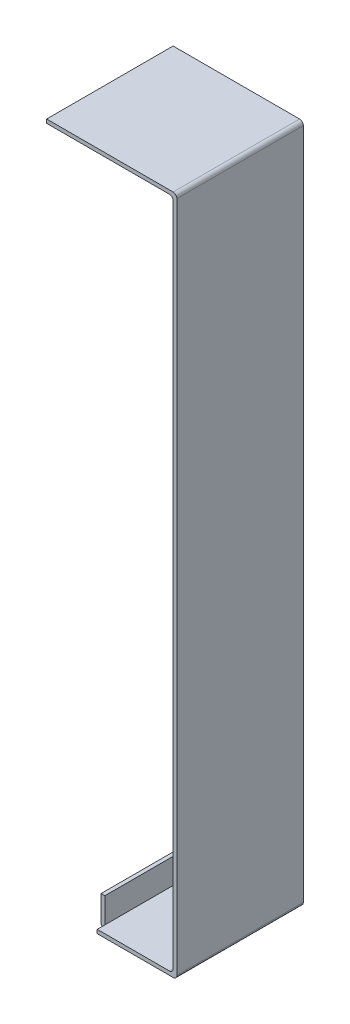
ISO-10303-21;
HEADER;
FILE_DESCRIPTION(('STEP AP214'),'2;1');
FILE_NAME('part.step','',(''),(''),'','','');
FILE_SCHEMA(('AUTOMOTIVE_DESIGN { 1 0 10303 214 1 1 1 1 }'));
ENDSEC;
DATA;
#1=APPLICATION_CONTEXT('core data for automotive mechanical design processes');
#2=APPLICATION_PROTOCOL_DEFINITION('international standard','automotive_design',2000,#1);
#3=PRODUCT_CONTEXT('',#1,'mechanical');
#4=PRODUCT('Part','Part','',(#3));
#5=PRODUCT_RELATED_PRODUCT_CATEGORY('part','',(#4));
#6=PRODUCT_DEFINITION_FORMATION('','',#4);
#7=PRODUCT_DEFINITION_CONTEXT('part definition',#1,'design');
#8=PRODUCT_DEFINITION('design','',#6,#7);
#9=PRODUCT_DEFINITION_SHAPE('','',#8);
#10=(LENGTH_UNIT() NAMED_UNIT(*) SI_UNIT(.MILLI.,.METRE.));
#11=(NAMED_UNIT(*) PLANE_ANGLE_UNIT() SI_UNIT($,.RADIAN.));
#12=(NAMED_UNIT(*) SI_UNIT($,.STERADIAN.) SOLID_ANGLE_UNIT());
#13=UNCERTAINTY_MEASURE_WITH_UNIT(LENGTH_MEASURE(1.E-05),#10,'distance_accuracy_value','');
#14=(GEOMETRIC_REPRESENTATION_CONTEXT(3) GLOBAL_UNCERTAINTY_ASSIGNED_CONTEXT((#13)) GLOBAL_UNIT_ASSIGNED_CONTEXT((#10,
#11,#12)) REPRESENTATION_CONTEXT('',''));
#15=CARTESIAN_POINT('',(0.,0.,0.));
#16=DIRECTION('',(0.,0.,1.));
#17=DIRECTION('',(1.,0.,0.));
#18=AXIS2_PLACEMENT_3D('',#15,#16,#17);
#19=CARTESIAN_POINT('',(15.8546023661732,-222.027370152263,50.));
#20=DIRECTION('',(0.,0.,1.));
#21=DIRECTION('',(1.,0.,0.));
#22=AXIS2_PLACEMENT_3D('',#19,#20,#21);
#23=CYLINDRICAL_SURFACE('',#22,1.5);
#24=DIRECTION('',(0.,0.,1.));
#25=VECTOR('',#24,1.);
#26=CARTESIAN_POINT('',(14.3546023661732,-222.027370152263,50.));
#27=LINE('',#26,#25);
#28=CARTESIAN_POINT('',(14.3546023661732,-222.027370152263,3.));
#29=VERTEX_POINT('',#28);
#30=CARTESIAN_POINT('',(14.3546023661732,-222.027370152263,47.));
#31=VERTEX_POINT('',#30);
#32=EDGE_CURVE('E200',#29,#31,#27,.T.);
#33=ORIENTED_EDGE('',*,*,#32,.F.);
#34=CARTESIAN_POINT('',(15.8546023661732,-222.027370152263,3.));
#35=DIRECTION('',(0.,0.,1.));
#36=DIRECTION('',(1.,0.,0.));
#37=AXIS2_PLACEMENT_3D('',#34,#35,#36);
#38=CIRCLE('',#37,1.5);
#39=CARTESIAN_POINT('',(15.8546023661732,-223.527370152263,3.));
#40=VERTEX_POINT('',#39);
#41=EDGE_CURVE('E42',#40,#29,#38,.F.);
#42=ORIENTED_EDGE('',*,*,#41,.F.);
#43=DIRECTION('',(0.,0.,1.));
#44=VECTOR('',#43,1.);
#45=CARTESIAN_POINT('',(15.8546023661732,-223.527370152263,50.));
#46=LINE('',#45,#44);
#47=CARTESIAN_POINT('',(15.8546023661732,-223.527370152263,47.));
#48=VERTEX_POINT('',#47);
#49=EDGE_CURVE('E202',#48,#40,#46,.F.);
#50=ORIENTED_EDGE('',*,*,#49,.F.);
#51=CARTESIAN_POINT('',(15.8546023661732,-222.027370152263,47.));
#52=DIRECTION('',(0.,0.,-1.));
#53=DIRECTION('',(-1.,0.,0.));
#54=AXIS2_PLACEMENT_3D('',#51,#52,#53);
#55=CIRCLE('',#54,1.5);
#56=EDGE_CURVE('E11',#31,#48,#55,.F.);
#57=ORIENTED_EDGE('',*,*,#56,.F.);
#58=EDGE_LOOP('',(#33,#42,#50,#57));
#59=FACE_BOUND('',#58,.T.);
#60=ADVANCED_FACE('F35',(#59),#23,.T.);
#61=CARTESIAN_POINT('',(45.8546023661733,43.9726298477373,0.));
#62=DIRECTION('',(0.,0.,-1.));
#63=DIRECTION('',(-1.,0.,0.));
#64=AXIS2_PLACEMENT_3D('',#61,#62,#63);
#65=PLANE('',#64);
#66=DIRECTION('',(1.,0.,0.));
#67=VECTOR('',#66,1.);
#68=CARTESIAN_POINT('',(14.3546023661732,-223.527370152263,0.));
#69=LINE('',#68,#67);
#70=CARTESIAN_POINT('',(15.8546023661732,-223.527370152263,0.));
#71=VERTEX_POINT('',#70);
#72=CARTESIAN_POINT('',(45.8546023661732,-223.527370152263,0.));
#73=VERTEX_POINT('',#72);
#74=EDGE_CURVE('E264',#71,#73,#69,.T.);
#75=ORIENTED_EDGE('',*,*,#74,.F.);
#76=DIRECTION('',(0.,1.,0.));
#77=VECTOR('',#76,1.);
#78=CARTESIAN_POINT('',(15.8546023661733,43.9726298477373,0.));
#79=LINE('',#78,#77);
#80=CARTESIAN_POINT('',(15.8546023661732,-222.027370152263,0.));
#81=VERTEX_POINT('',#80);
#82=EDGE_CURVE('E197',#71,#81,#79,.T.);
#83=ORIENTED_EDGE('',*,*,#82,.T.);
#84=DIRECTION('',(-1.,0.,0.));
#85=VECTOR('',#84,1.);
#86=CARTESIAN_POINT('',(44.3546023661732,-222.027370152263,0.));
#87=LINE('',#86,#85);
#88=CARTESIAN_POINT('',(44.3546023661732,-222.027370152263,0.));
#89=VERTEX_POINT('',#88);
#90=EDGE_CURVE('E261',#89,#81,#87,.T.);
#91=ORIENTED_EDGE('',*,*,#90,.F.);
#92=CARTESIAN_POINT('',(44.3546023661733,-220.527370152263,0.));
#93=DIRECTION('',(0.,0.,-1.));
#94=DIRECTION('',(1.,0.,0.));
#95=AXIS2_PLACEMENT_3D('',#92,#93,#94);
#96=CIRCLE('',#95,1.5);
#97=CARTESIAN_POINT('',(45.8546023661733,-220.527370152263,0.));
#98=VERTEX_POINT('',#97);
#99=EDGE_CURVE('E259',#98,#89,#96,.T.);
#100=ORIENTED_EDGE('',*,*,#99,.F.);
#101=DIRECTION('',(0.,-1.,0.));
#102=VECTOR('',#101,1.);
#103=CARTESIAN_POINT('',(45.8546023661733,-212.027370152263,0.));
#104=LINE('',#103,#102);
#105=CARTESIAN_POINT('',(45.8546023661732,42.4726298477373,0.));
#106=VERTEX_POINT('',#105);
#107=EDGE_CURVE('E257',#106,#98,#104,.T.);
#108=ORIENTED_EDGE('',*,*,#107,.F.);
#109=CARTESIAN_POINT('',(44.3546023661732,42.4726298477373,0.));
#110=DIRECTION('',(0.,0.,-1.));
#111=DIRECTION('',(1.,0.,0.));
#112=AXIS2_PLACEMENT_3D('',#109,#110,#111);
#113=CIRCLE('',#112,1.5);
#114=CARTESIAN_POINT('',(44.3546023661732,43.9726298477373,0.));
#115=VERTEX_POINT('',#114);
#116=EDGE_CURVE('E254',#115,#106,#113,.T.);
#117=ORIENTED_EDGE('',*,*,#116,.F.);
#118=DIRECTION('',(1.,0.,0.));
#119=VECTOR('',#118,1.);
#120=CARTESIAN_POINT('',(44.3546023661732,43.9726298477373,0.));
#121=LINE('',#120,#119);
#122=CARTESIAN_POINT('',(-4.14539763382678,43.9726298477373,0.));
#123=VERTEX_POINT('',#122);
#124=EDGE_CURVE('E227',#123,#115,#121,.T.);
#125=ORIENTED_EDGE('',*,*,#124,.F.);
#126=DIRECTION('',(0.,-1.,0.));
#127=VECTOR('',#126,1.);
#128=CARTESIAN_POINT('',(-4.14539763382678,45.4726298477373,0.));
#129=LINE('',#128,#127);
#130=CARTESIAN_POINT('',(-4.14539763382678,45.4726298477373,0.));
#131=VERTEX_POINT('',#130);
#132=EDGE_CURVE('E231',#131,#123,#129,.T.);
#133=ORIENTED_EDGE('',*,*,#132,.F.);
#134=DIRECTION('',(-1.,0.,0.));
#135=VECTOR('',#134,1.);
#136=CARTESIAN_POINT('',(45.8546023661732,45.4726298477373,0.));
#137=LINE('',#136,#135);
#138=CARTESIAN_POINT('',(45.8546023661732,45.4726298477373,0.));
#139=VERTEX_POINT('',#138);
#140=EDGE_CURVE('E272',#139,#131,#137,.T.);
#141=ORIENTED_EDGE('',*,*,#140,.F.);
#142=CARTESIAN_POINT('',(45.8546023661733,43.9726298477373,0.));
#143=DIRECTION('',(0.,0.,1.));
#144=DIRECTION('',(-1.,0.,0.));
#145=AXIS2_PLACEMENT_3D('',#142,#143,#144);
#146=CIRCLE('',#145,1.5);
#147=CARTESIAN_POINT('',(47.3546023661733,43.9726298477373,0.));
#148=VERTEX_POINT('',#147);
#149=EDGE_CURVE('E270',#148,#139,#146,.T.);
#150=ORIENTED_EDGE('',*,*,#149,.F.);
#151=DIRECTION('',(0.,1.,0.));
#152=VECTOR('',#151,1.);
#153=CARTESIAN_POINT('',(47.3546023661733,-222.027370152263,0.));
#154=LINE('',#153,#152);
#155=CARTESIAN_POINT('',(47.3546023661733,-222.027370152263,0.));
#156=VERTEX_POINT('',#155);
#157=EDGE_CURVE('E268',#156,#148,#154,.T.);
#158=ORIENTED_EDGE('',*,*,#157,.F.);
#159=CARTESIAN_POINT('',(45.8546023661733,-222.027370152263,0.));
#160=DIRECTION('',(0.,0.,1.));
#161=DIRECTION('',(1.,0.,0.));
#162=AXIS2_PLACEMENT_3D('',#159,#160,#161);
#163=CIRCLE('',#162,1.5);
#164=EDGE_CURVE('E266',#73,#156,#163,.T.);
#165=ORIENTED_EDGE('',*,*,#164,.F.);
#166=EDGE_LOOP('',(#75,#83,#91,#100,#108,#117,#125,#133,#141,#150,#158,#165));
#167=FACE_BOUND('',#166,.T.);
#168=ADVANCED_FACE('F298',(#167),#65,.T.);
#169=CARTESIAN_POINT('',(44.3546023661732,43.9726298477373,50.));
#170=DIRECTION('',(0.,1.,0.));
#171=DIRECTION('',(0.,0.,1.));
#172=AXIS2_PLACEMENT_3D('',#169,#170,#171);
#173=PLANE('',#172);
#174=ORIENTED_EDGE('',*,*,#124,.T.);
#175=DIRECTION('',(0.,0.,-1.));
#176=VECTOR('',#175,1.);
#177=CARTESIAN_POINT('',(44.3546023661732,43.9726298477373,50.));
#178=LINE('',#177,#176);
#179=CARTESIAN_POINT('',(44.3546023661732,43.9726298477373,50.));
#180=VERTEX_POINT('',#179);
#181=EDGE_CURVE('E194',#180,#115,#178,.T.);
#182=ORIENTED_EDGE('',*,*,#181,.F.);
#183=DIRECTION('',(1.,0.,0.));
#184=VECTOR('',#183,1.);
#185=CARTESIAN_POINT('',(15.8546023661732,43.9726298477373,50.));
#186=LINE('',#185,#184);
#187=CARTESIAN_POINT('',(-4.14539763382678,43.9726298477373,50.));
#188=VERTEX_POINT('',#187);
#189=EDGE_CURVE('E228',#188,#180,#186,.T.);
#190=ORIENTED_EDGE('',*,*,#189,.F.);
#191=DIRECTION('',(0.,0.,-1.));
#192=VECTOR('',#191,1.);
#193=CARTESIAN_POINT('',(-4.14539763382678,43.9726298477373,50.));
#194=LINE('',#193,#192);
#195=EDGE_CURVE('E252',#188,#123,#194,.T.);
#196=ORIENTED_EDGE('',*,*,#195,.T.);
#197=EDGE_LOOP('',(#174,#182,#190,#196));
#198=FACE_BOUND('',#197,.T.);
#199=ADVANCED_FACE('F347',(#198),#173,.F.);
#200=CARTESIAN_POINT('',(44.3546023661732,42.4726298477373,50.));
#201=DIRECTION('',(0.,0.,-1.));
#202=DIRECTION('',(-1.,0.,0.));
#203=AXIS2_PLACEMENT_3D('',#200,#201,#202);
#204=CYLINDRICAL_SURFACE('',#203,1.5);
#205=ORIENTED_EDGE('',*,*,#116,.T.);
#206=DIRECTION('',(0.,0.,-1.));
#207=VECTOR('',#206,1.);
#208=CARTESIAN_POINT('',(45.8546023661732,42.4726298477373,50.));
#209=LINE('',#208,#207);
#210=CARTESIAN_POINT('',(45.8546023661732,42.4726298477373,50.));
#211=VERTEX_POINT('',#210);
#212=EDGE_CURVE('E191',#211,#106,#209,.T.);
#213=ORIENTED_EDGE('',*,*,#212,.F.);
#214=CARTESIAN_POINT('',(44.3546023661732,42.4726298477373,50.));
#215=DIRECTION('',(0.,0.,-1.));
#216=DIRECTION('',(1.,0.,0.));
#217=AXIS2_PLACEMENT_3D('',#214,#215,#216);
#218=CIRCLE('',#217,1.5);
#219=EDGE_CURVE('E230',#180,#211,#218,.T.);
#220=ORIENTED_EDGE('',*,*,#219,.F.);
#221=ORIENTED_EDGE('',*,*,#181,.T.);
#222=EDGE_LOOP('',(#205,#213,#220,#221));
#223=FACE_BOUND('',#222,.T.);
#224=ADVANCED_FACE('F338',(#223),#204,.F.);
#225=CARTESIAN_POINT('',(45.8546023661733,-212.027370152263,50.));
#226=DIRECTION('',(1.,0.,0.));
#227=DIRECTION('',(0.,0.,-1.));
#228=AXIS2_PLACEMENT_3D('',#225,#226,#227);
#229=PLANE('',#228);
#230=ORIENTED_EDGE('',*,*,#107,.T.);
#231=DIRECTION('',(0.,0.,-1.));
#232=VECTOR('',#231,1.);
#233=CARTESIAN_POINT('',(45.8546023661733,-220.527370152263,50.));
#234=LINE('',#233,#232);
#235=CARTESIAN_POINT('',(45.8546023661733,-220.527370152263,50.));
#236=VERTEX_POINT('',#235);
#237=EDGE_CURVE('E188',#236,#98,#234,.T.);
#238=ORIENTED_EDGE('',*,*,#237,.F.);
#239=DIRECTION('',(0.,-1.,0.));
#240=VECTOR('',#239,1.);
#241=CARTESIAN_POINT('',(45.8546023661732,42.4726298477373,50.));
#242=LINE('',#241,#240);
#243=EDGE_CURVE('E233',#211,#236,#242,.T.);
#244=ORIENTED_EDGE('',*,*,#243,.F.);
#245=ORIENTED_EDGE('',*,*,#212,.T.);
#246=EDGE_LOOP('',(#230,#238,#244,#245));
#247=FACE_BOUND('',#246,.T.);
#248=ADVANCED_FACE('F334',(#247),#229,.F.);
#249=CARTESIAN_POINT('',(44.3546023661733,-220.527370152263,50.));
#250=DIRECTION('',(0.,0.,-1.));
#251=DIRECTION('',(-1.,0.,0.));
#252=AXIS2_PLACEMENT_3D('',#249,#250,#251);
#253=CYLINDRICAL_SURFACE('',#252,1.5);
#254=ORIENTED_EDGE('',*,*,#99,.T.);
#255=DIRECTION('',(0.,0.,-1.));
#256=VECTOR('',#255,1.);
#257=CARTESIAN_POINT('',(44.3546023661732,-222.027370152263,50.));
#258=LINE('',#257,#256);
#259=CARTESIAN_POINT('',(44.3546023661732,-222.027370152263,50.));
#260=VERTEX_POINT('',#259);
#261=EDGE_CURVE('E185',#260,#89,#258,.T.);
#262=ORIENTED_EDGE('',*,*,#261,.F.);
#263=CARTESIAN_POINT('',(44.3546023661733,-220.527370152263,50.));
#264=DIRECTION('',(0.,0.,-1.));
#265=DIRECTION('',(1.,0.,0.));
#266=AXIS2_PLACEMENT_3D('',#263,#264,#265);
#267=CIRCLE('',#266,1.5);
#268=EDGE_CURVE('E235',#236,#260,#267,.T.);
#269=ORIENTED_EDGE('',*,*,#268,.F.);
#270=ORIENTED_EDGE('',*,*,#237,.T.);
#271=EDGE_LOOP('',(#254,#262,#269,#270));
#272=FACE_BOUND('',#271,.T.);
#273=ADVANCED_FACE('F329',(#272),#253,.F.);
#274=CARTESIAN_POINT('',(44.3546023661732,-222.027370152263,50.));
#275=DIRECTION('',(0.,-1.,0.));
#276=DIRECTION('',(0.,0.,-1.));
#277=AXIS2_PLACEMENT_3D('',#274,#275,#276);
#278=PLANE('',#277);
#279=ORIENTED_EDGE('',*,*,#90,.T.);
#280=DIRECTION('',(0.,0.,-1.));
#281=VECTOR('',#280,1.);
#282=CARTESIAN_POINT('',(15.8546023661732,-222.027370152263,50.));
#283=LINE('',#282,#281);
#284=CARTESIAN_POINT('',(15.8546023661732,-222.027370152263,3.));
#285=VERTEX_POINT('',#284);
#286=EDGE_CURVE('E172',#285,#81,#283,.T.);
#287=ORIENTED_EDGE('',*,*,#286,.F.);
#288=DIRECTION('',(0.,0.,-1.));
#289=VECTOR('',#288,1.);
#290=CARTESIAN_POINT('',(15.8546023661732,-222.027370152263,50.));
#291=LINE('',#290,#289);
#292=CARTESIAN_POINT('',(15.8546023661732,-222.027370152263,47.));
#293=VERTEX_POINT('',#292);
#294=EDGE_CURVE('E177',#293,#285,#291,.T.);
#295=ORIENTED_EDGE('',*,*,#294,.F.);
#296=CARTESIAN_POINT('',(15.8546023661732,-222.027370152263,50.));
#297=VERTEX_POINT('',#296);
#298=EDGE_CURVE('E179',#297,#293,#291,.T.);
#299=ORIENTED_EDGE('',*,*,#298,.F.);
#300=DIRECTION('',(-1.,0.,0.));
#301=VECTOR('',#300,1.);
#302=CARTESIAN_POINT('',(44.3546023661732,-222.027370152263,50.));
#303=LINE('',#302,#301);
#304=EDGE_CURVE('E237',#260,#297,#303,.T.);
#305=ORIENTED_EDGE('',*,*,#304,.F.);
#306=ORIENTED_EDGE('',*,*,#261,.T.);
#307=EDGE_LOOP('',(#279,#287,#295,#299,#305,#306));
#308=FACE_BOUND('',#307,.T.);
#309=ADVANCED_FACE('F323',(#308),#278,.F.);
#310=CARTESIAN_POINT('',(15.8546023661732,-222.027370152263,50.));
#311=DIRECTION('',(-1.,0.,0.));
#312=DIRECTION('',(0.,0.,1.));
#313=AXIS2_PLACEMENT_3D('',#310,#311,#312);
#314=PLANE('',#313);
#315=DIRECTION('',(0.,0.,-1.));
#316=VECTOR('',#315,1.);
#317=CARTESIAN_POINT('',(15.8546023661732,-212.027370152263,50.));
#318=LINE('',#317,#316);
#319=CARTESIAN_POINT('',(15.8546023661732,-212.027370152263,47.));
#320=VERTEX_POINT('',#319);
#321=CARTESIAN_POINT('',(15.8546023661732,-212.027370152263,3.));
#322=VERTEX_POINT('',#321);
#323=EDGE_CURVE('E169',#320,#322,#318,.T.);
#324=ORIENTED_EDGE('',*,*,#323,.F.);
#325=DIRECTION('',(0.,-1.,0.));
#326=VECTOR('',#325,1.);
#327=CARTESIAN_POINT('',(15.8546023661732,-223.527370152263,47.));
#328=LINE('',#327,#326);
#329=EDGE_CURVE('E150',#320,#293,#328,.T.);
#330=ORIENTED_EDGE('',*,*,#329,.T.);
#331=ORIENTED_EDGE('',*,*,#294,.T.);
#332=DIRECTION('',(0.,1.,0.));
#333=VECTOR('',#332,1.);
#334=CARTESIAN_POINT('',(15.8546023661732,-223.527370152263,3.));
#335=LINE('',#334,#333);
#336=EDGE_CURVE('E176',#285,#322,#335,.T.);
#337=ORIENTED_EDGE('',*,*,#336,.T.);
#338=EDGE_LOOP('',(#324,#330,#331,#337));
#339=FACE_BOUND('',#338,.T.);
#340=ADVANCED_FACE('F175',(#339),#314,.F.);
#341=CARTESIAN_POINT('',(15.8546023661732,-212.027370152263,50.));
#342=DIRECTION('',(0.,-1.,0.));
#343=DIRECTION('',(0.,0.,-1.));
#344=AXIS2_PLACEMENT_3D('',#341,#342,#343);
#345=PLANE('',#344);
#346=DIRECTION('',(0.,0.,-1.));
#347=VECTOR('',#346,1.);
#348=CARTESIAN_POINT('',(14.3546023661732,-212.027370152263,50.));
#349=LINE('',#348,#347);
#350=CARTESIAN_POINT('',(14.3546023661732,-212.027370152263,47.));
#351=VERTEX_POINT('',#350);
#352=CARTESIAN_POINT('',(14.3546023661732,-212.027370152263,3.));
#353=VERTEX_POINT('',#352);
#354=EDGE_CURVE('E171',#351,#353,#349,.T.);
#355=ORIENTED_EDGE('',*,*,#354,.F.);
#356=DIRECTION('',(-1.,0.,0.));
#357=VECTOR('',#356,1.);
#358=CARTESIAN_POINT('',(15.8546023661732,-212.027370152263,47.));
#359=LINE('',#358,#357);
#360=EDGE_CURVE('E154',#320,#351,#359,.T.);
#361=ORIENTED_EDGE('',*,*,#360,.F.);
#362=ORIENTED_EDGE('',*,*,#323,.T.);
#363=DIRECTION('',(-1.,0.,0.));
#364=VECTOR('',#363,1.);
#365=CARTESIAN_POINT('',(15.8546023661732,-212.027370152263,3.));
#366=LINE('',#365,#364);
#367=EDGE_CURVE('E220',#322,#353,#366,.T.);
#368=ORIENTED_EDGE('',*,*,#367,.T.);
#369=EDGE_LOOP('',(#355,#361,#362,#368));
#370=FACE_BOUND('',#369,.T.);
#371=ADVANCED_FACE('F167',(#370),#345,.F.);
#372=CARTESIAN_POINT('',(14.3546023661732,-212.027370152263,50.));
#373=DIRECTION('',(1.,0.,0.));
#374=DIRECTION('',(0.,1.,0.));
#375=AXIS2_PLACEMENT_3D('',#372,#373,#374);
#376=PLANE('',#375);
#377=DIRECTION('',(0.,1.,0.));
#378=VECTOR('',#377,1.);
#379=CARTESIAN_POINT('',(14.3546023661732,-223.527370152263,3.));
#380=LINE('',#379,#378);
#381=EDGE_CURVE('E217',#29,#353,#380,.T.);
#382=ORIENTED_EDGE('',*,*,#381,.F.);
#383=ORIENTED_EDGE('',*,*,#32,.T.);
#384=DIRECTION('',(0.,-1.,0.));
#385=VECTOR('',#384,1.);
#386=CARTESIAN_POINT('',(14.3546023661732,-223.527370152263,47.));
#387=LINE('',#386,#385);
#388=EDGE_CURVE('E222',#351,#31,#387,.T.);
#389=ORIENTED_EDGE('',*,*,#388,.F.);
#390=ORIENTED_EDGE('',*,*,#354,.T.);
#391=EDGE_LOOP('',(#382,#383,#389,#390));
#392=FACE_BOUND('',#391,.T.);
#393=ADVANCED_FACE('F362',(#392),#376,.F.);
#394=CARTESIAN_POINT('',(14.3546023661732,-223.527370152263,50.));
#395=DIRECTION('',(0.,1.,0.));
#396=DIRECTION('',(0.,0.,1.));
#397=AXIS2_PLACEMENT_3D('',#394,#395,#396);
#398=PLANE('',#397);
#399=DIRECTION('',(0.,0.,1.));
#400=VECTOR('',#399,1.);
#401=CARTESIAN_POINT('',(15.8546023661732,-223.527370152263,50.));
#402=LINE('',#401,#400);
#403=CARTESIAN_POINT('',(15.8546023661732,-223.527370152263,50.));
#404=VERTEX_POINT('',#403);
#405=EDGE_CURVE('E162',#48,#404,#402,.T.);
#406=ORIENTED_EDGE('',*,*,#405,.F.);
#407=ORIENTED_EDGE('',*,*,#49,.T.);
#408=DIRECTION('',(0.,0.,1.));
#409=VECTOR('',#408,1.);
#410=CARTESIAN_POINT('',(15.8546023661732,-223.527370152263,0.));
#411=LINE('',#410,#409);
#412=EDGE_CURVE('E209',#71,#40,#411,.T.);
#413=ORIENTED_EDGE('',*,*,#412,.F.);
#414=ORIENTED_EDGE('',*,*,#74,.T.);
#415=DIRECTION('',(0.,0.,-1.));
#416=VECTOR('',#415,1.);
#417=CARTESIAN_POINT('',(45.8546023661732,-223.527370152263,50.));
#418=LINE('',#417,#416);
#419=CARTESIAN_POINT('',(45.8546023661732,-223.527370152263,50.));
#420=VERTEX_POINT('',#419);
#421=EDGE_CURVE('E181',#420,#73,#418,.T.);
#422=ORIENTED_EDGE('',*,*,#421,.F.);
#423=DIRECTION('',(1.,0.,0.));
#424=VECTOR('',#423,1.);
#425=CARTESIAN_POINT('',(14.3546023661732,-223.527370152263,50.));
#426=LINE('',#425,#424);
#427=EDGE_CURVE('E240',#404,#420,#426,.T.);
#428=ORIENTED_EDGE('',*,*,#427,.F.);
#429=EDGE_LOOP('',(#406,#407,#413,#414,#422,#428));
#430=FACE_BOUND('',#429,.T.);
#431=ADVANCED_FACE('F208',(#430),#398,.F.);
#432=CARTESIAN_POINT('',(45.8546023661733,-222.027370152263,50.));
#433=DIRECTION('',(0.,0.,-1.));
#434=DIRECTION('',(-1.,0.,0.));
#435=AXIS2_PLACEMENT_3D('',#432,#433,#434);
#436=CYLINDRICAL_SURFACE('',#435,1.5);
#437=ORIENTED_EDGE('',*,*,#164,.T.);
#438=DIRECTION('',(0.,0.,-1.));
#439=VECTOR('',#438,1.);
#440=CARTESIAN_POINT('',(47.3546023661733,-222.027370152263,50.));
#441=LINE('',#440,#439);
#442=CARTESIAN_POINT('',(47.3546023661733,-222.027370152263,50.));
#443=VERTEX_POINT('',#442);
#444=EDGE_CURVE('E287',#443,#156,#441,.T.);
#445=ORIENTED_EDGE('',*,*,#444,.F.);
#446=CARTESIAN_POINT('',(45.8546023661733,-222.027370152263,50.));
#447=DIRECTION('',(0.,0.,1.));
#448=DIRECTION('',(1.,0.,0.));
#449=AXIS2_PLACEMENT_3D('',#446,#447,#448);
#450=CIRCLE('',#449,1.5);
#451=EDGE_CURVE('E242',#420,#443,#450,.T.);
#452=ORIENTED_EDGE('',*,*,#451,.F.);
#453=ORIENTED_EDGE('',*,*,#421,.T.);
#454=EDGE_LOOP('',(#437,#445,#452,#453));
#455=FACE_BOUND('',#454,.T.);
#456=ADVANCED_FACE('F294',(#455),#436,.T.);
#457=CARTESIAN_POINT('',(47.3546023661733,-222.027370152263,50.));
#458=DIRECTION('',(-1.,0.,0.));
#459=DIRECTION('',(0.,0.,1.));
#460=AXIS2_PLACEMENT_3D('',#457,#458,#459);
#461=PLANE('',#460);
#462=ORIENTED_EDGE('',*,*,#157,.T.);
#463=DIRECTION('',(0.,0.,-1.));
#464=VECTOR('',#463,1.);
#465=CARTESIAN_POINT('',(47.3546023661733,43.9726298477373,50.));
#466=LINE('',#465,#464);
#467=CARTESIAN_POINT('',(47.3546023661733,43.9726298477373,50.));
#468=VERTEX_POINT('',#467);
#469=EDGE_CURVE('E284',#468,#148,#466,.T.);
#470=ORIENTED_EDGE('',*,*,#469,.F.);
#471=DIRECTION('',(0.,1.,0.));
#472=VECTOR('',#471,1.);
#473=CARTESIAN_POINT('',(47.3546023661733,-222.027370152263,50.));
#474=LINE('',#473,#472);
#475=EDGE_CURVE('E244',#443,#468,#474,.T.);
#476=ORIENTED_EDGE('',*,*,#475,.F.);
#477=ORIENTED_EDGE('',*,*,#444,.T.);
#478=EDGE_LOOP('',(#462,#470,#476,#477));
#479=FACE_BOUND('',#478,.T.);
#480=ADVANCED_FACE('F303',(#479),#461,.F.);
#481=CARTESIAN_POINT('',(45.8546023661733,43.9726298477373,50.));
#482=DIRECTION('',(0.,0.,-1.));
#483=DIRECTION('',(-1.,0.,0.));
#484=AXIS2_PLACEMENT_3D('',#481,#482,#483);
#485=CYLINDRICAL_SURFACE('',#484,1.5);
#486=ORIENTED_EDGE('',*,*,#149,.T.);
#487=DIRECTION('',(0.,0.,-1.));
#488=VECTOR('',#487,1.);
#489=CARTESIAN_POINT('',(45.8546023661732,45.4726298477373,50.));
#490=LINE('',#489,#488);
#491=CARTESIAN_POINT('',(45.8546023661732,45.4726298477373,50.));
#492=VERTEX_POINT('',#491);
#493=EDGE_CURVE('E281',#492,#139,#490,.T.);
#494=ORIENTED_EDGE('',*,*,#493,.F.);
#495=CARTESIAN_POINT('',(45.8546023661733,43.9726298477373,50.));
#496=DIRECTION('',(0.,0.,1.));
#497=DIRECTION('',(-1.,0.,0.));
#498=AXIS2_PLACEMENT_3D('',#495,#496,#497);
#499=CIRCLE('',#498,1.5);
#500=EDGE_CURVE('E246',#468,#492,#499,.T.);
#501=ORIENTED_EDGE('',*,*,#500,.F.);
#502=ORIENTED_EDGE('',*,*,#469,.T.);
#503=EDGE_LOOP('',(#486,#494,#501,#502));
#504=FACE_BOUND('',#503,.T.);
#505=ADVANCED_FACE('F307',(#504),#485,.T.);
#506=CARTESIAN_POINT('',(45.8546023661732,45.4726298477373,50.));
#507=DIRECTION('',(0.,-1.,0.));
#508=DIRECTION('',(0.,0.,-1.));
#509=AXIS2_PLACEMENT_3D('',#506,#507,#508);
#510=PLANE('',#509);
#511=ORIENTED_EDGE('',*,*,#140,.T.);
#512=DIRECTION('',(0.,0.,-1.));
#513=VECTOR('',#512,1.);
#514=CARTESIAN_POINT('',(-4.14539763382678,45.4726298477373,50.));
#515=LINE('',#514,#513);
#516=CARTESIAN_POINT('',(-4.14539763382678,45.4726298477373,50.));
#517=VERTEX_POINT('',#516);
#518=EDGE_CURVE('E278',#517,#131,#515,.T.);
#519=ORIENTED_EDGE('',*,*,#518,.F.);
#520=DIRECTION('',(-1.,0.,0.));
#521=VECTOR('',#520,1.);
#522=CARTESIAN_POINT('',(45.8546023661732,45.4726298477373,50.));
#523=LINE('',#522,#521);
#524=EDGE_CURVE('E248',#492,#517,#523,.T.);
#525=ORIENTED_EDGE('',*,*,#524,.F.);
#526=ORIENTED_EDGE('',*,*,#493,.T.);
#527=EDGE_LOOP('',(#511,#519,#525,#526));
#528=FACE_BOUND('',#527,.T.);
#529=ADVANCED_FACE('F435',(#528),#510,.F.);
#530=CARTESIAN_POINT('',(-4.14539763382678,45.4726298477373,50.));
#531=DIRECTION('',(1.,0.,0.));
#532=DIRECTION('',(0.,0.,-1.));
#533=AXIS2_PLACEMENT_3D('',#530,#531,#532);
#534=PLANE('',#533);
#535=ORIENTED_EDGE('',*,*,#132,.T.);
#536=ORIENTED_EDGE('',*,*,#195,.F.);
#537=DIRECTION('',(0.,-1.,0.));
#538=VECTOR('',#537,1.);
#539=CARTESIAN_POINT('',(-4.14539763382678,45.4726298477373,50.));
#540=LINE('',#539,#538);
#541=EDGE_CURVE('E250',#517,#188,#540,.T.);
#542=ORIENTED_EDGE('',*,*,#541,.F.);
#543=ORIENTED_EDGE('',*,*,#518,.T.);
#544=EDGE_LOOP('',(#535,#536,#542,#543));
#545=FACE_BOUND('',#544,.T.);
#546=ADVANCED_FACE('F344',(#545),#534,.F.);
#547=CARTESIAN_POINT('',(45.8546023661733,43.9726298477373,50.));
#548=DIRECTION('',(0.,0.,-1.));
#549=DIRECTION('',(-1.,0.,0.));
#550=AXIS2_PLACEMENT_3D('',#547,#548,#549);
#551=PLANE('',#550);
#552=ORIENTED_EDGE('',*,*,#304,.T.);
#553=DIRECTION('',(0.,1.,0.));
#554=VECTOR('',#553,1.);
#555=CARTESIAN_POINT('',(15.8546023661732,-212.027370152263,50.));
#556=LINE('',#555,#554);
#557=EDGE_CURVE('E314',#404,#297,#556,.T.);
#558=ORIENTED_EDGE('',*,*,#557,.F.);
#559=ORIENTED_EDGE('',*,*,#427,.T.);
#560=ORIENTED_EDGE('',*,*,#451,.T.);
#561=ORIENTED_EDGE('',*,*,#475,.T.);
#562=ORIENTED_EDGE('',*,*,#500,.T.);
#563=ORIENTED_EDGE('',*,*,#524,.T.);
#564=ORIENTED_EDGE('',*,*,#541,.T.);
#565=ORIENTED_EDGE('',*,*,#189,.T.);
#566=ORIENTED_EDGE('',*,*,#219,.T.);
#567=ORIENTED_EDGE('',*,*,#243,.T.);
#568=ORIENTED_EDGE('',*,*,#268,.T.);
#569=EDGE_LOOP('',(#552,#558,#559,#560,#561,#562,#563,#564,#565,#566,#567,#568));
#570=FACE_BOUND('',#569,.T.);
#571=ADVANCED_FACE('F311',(#570),#551,.F.);
#572=CARTESIAN_POINT('',(15.8546023661733,0.,0.));
#573=DIRECTION('',(-1.,0.,0.));
#574=DIRECTION('',(0.,-1.,0.));
#575=AXIS2_PLACEMENT_3D('',#572,#573,#574);
#576=PLANE('',#575);
#577=ORIENTED_EDGE('',*,*,#286,.T.);
#578=ORIENTED_EDGE('',*,*,#82,.F.);
#579=ORIENTED_EDGE('',*,*,#412,.T.);
#580=EDGE_CURVE('E215',#40,#285,#335,.T.);
#581=ORIENTED_EDGE('',*,*,#580,.T.);
#582=EDGE_LOOP('',(#577,#578,#579,#581));
#583=FACE_BOUND('',#582,.T.);
#584=ADVANCED_FACE('F214',(#583),#576,.T.);
#585=CARTESIAN_POINT('',(15.8546023661732,-223.527370152263,3.));
#586=DIRECTION('',(0.,0.,1.));
#587=DIRECTION('',(1.,0.,0.));
#588=AXIS2_PLACEMENT_3D('',#585,#586,#587);
#589=PLANE('',#588);
#590=ORIENTED_EDGE('',*,*,#580,.F.);
#591=ORIENTED_EDGE('',*,*,#41,.T.);
#592=ORIENTED_EDGE('',*,*,#381,.T.);
#593=ORIENTED_EDGE('',*,*,#367,.F.);
#594=ORIENTED_EDGE('',*,*,#336,.F.);
#595=EDGE_LOOP('',(#590,#591,#592,#593,#594));
#596=FACE_BOUND('',#595,.T.);
#597=ADVANCED_FACE('F219',(#596),#589,.F.);
#598=CARTESIAN_POINT('',(15.8546023661733,0.,0.));
#599=DIRECTION('',(1.,0.,0.));
#600=DIRECTION('',(0.,1.,0.));
#601=AXIS2_PLACEMENT_3D('',#598,#599,#600);
#602=PLANE('',#601);
#603=EDGE_CURVE('E157',#293,#48,#328,.T.);
#604=ORIENTED_EDGE('',*,*,#603,.T.);
#605=ORIENTED_EDGE('',*,*,#405,.T.);
#606=ORIENTED_EDGE('',*,*,#557,.T.);
#607=ORIENTED_EDGE('',*,*,#298,.T.);
#608=EDGE_LOOP('',(#604,#605,#606,#607));
#609=FACE_BOUND('',#608,.T.);
#610=ADVANCED_FACE('F321',(#609),#602,.F.);
#611=CARTESIAN_POINT('',(15.8546023661732,-223.527370152263,47.));
#612=DIRECTION('',(0.,0.,-1.));
#613=DIRECTION('',(-1.,0.,0.));
#614=AXIS2_PLACEMENT_3D('',#611,#612,#613);
#615=PLANE('',#614);
#616=ORIENTED_EDGE('',*,*,#388,.T.);
#617=ORIENTED_EDGE('',*,*,#56,.T.);
#618=ORIENTED_EDGE('',*,*,#603,.F.);
#619=ORIENTED_EDGE('',*,*,#329,.F.);
#620=ORIENTED_EDGE('',*,*,#360,.T.);
#621=EDGE_LOOP('',(#616,#617,#618,#619,#620));
#622=FACE_BOUND('',#621,.T.);
#623=ADVANCED_FACE('F153',(#622),#615,.F.);
#624=CLOSED_SHELL('',(#60,#168,#199,#224,#248,#273,#309,#340,#371,#393,#431,#456,#480,#505,#529,
#546,#571,#584,#597,#610,#623));
#625=MANIFOLD_SOLID_BREP('B2',#624);
#626=ADVANCED_BREP_SHAPE_REPRESENTATION('',(#18,#625),#14);
#627=SHAPE_DEFINITION_REPRESENTATION(#9,#626);
ENDSEC;
END-ISO-10303-21;
